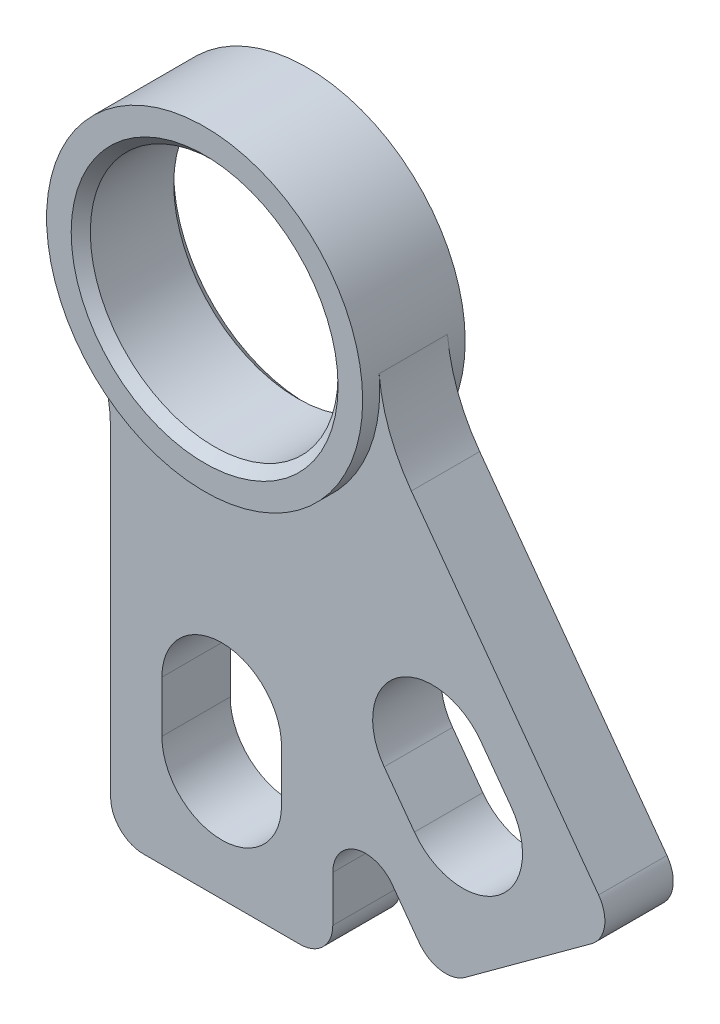
ISO-10303-21;
HEADER;
FILE_DESCRIPTION(('STEP AP214'),'2;1');
FILE_NAME('part.step','',(''),(''),'','','');
FILE_SCHEMA(('AUTOMOTIVE_DESIGN { 1 0 10303 214 1 1 1 1 }'));
ENDSEC;
DATA;
#1=APPLICATION_CONTEXT('core data for automotive mechanical design processes');
#2=APPLICATION_PROTOCOL_DEFINITION('international standard','automotive_design',2000,#1);
#3=PRODUCT_CONTEXT('',#1,'mechanical');
#4=PRODUCT('Part','Part','',(#3));
#5=PRODUCT_RELATED_PRODUCT_CATEGORY('part','',(#4));
#6=PRODUCT_DEFINITION_FORMATION('','',#4);
#7=PRODUCT_DEFINITION_CONTEXT('part definition',#1,'design');
#8=PRODUCT_DEFINITION('design','',#6,#7);
#9=PRODUCT_DEFINITION_SHAPE('','',#8);
#10=(LENGTH_UNIT() NAMED_UNIT(*) SI_UNIT(.MILLI.,.METRE.));
#11=(NAMED_UNIT(*) PLANE_ANGLE_UNIT() SI_UNIT($,.RADIAN.));
#12=(NAMED_UNIT(*) SI_UNIT($,.STERADIAN.) SOLID_ANGLE_UNIT());
#13=UNCERTAINTY_MEASURE_WITH_UNIT(LENGTH_MEASURE(1.E-05),#10,'distance_accuracy_value','');
#14=(GEOMETRIC_REPRESENTATION_CONTEXT(3) GLOBAL_UNCERTAINTY_ASSIGNED_CONTEXT((#13)) GLOBAL_UNIT_ASSIGNED_CONTEXT((#10,
#11,#12)) REPRESENTATION_CONTEXT('',''));
#15=CARTESIAN_POINT('',(0.,0.,0.));
#16=DIRECTION('',(0.,0.,1.));
#17=DIRECTION('',(1.,0.,0.));
#18=AXIS2_PLACEMENT_3D('',#15,#16,#17);
#19=CARTESIAN_POINT('',(0.,0.,4.7625));
#20=DIRECTION('',(0.,0.,-1.));
#21=DIRECTION('',(-1.,0.,0.));
#22=AXIS2_PLACEMENT_3D('',#19,#20,#21);
#23=CYLINDRICAL_SURFACE('',#22,11.5062);
#24=CARTESIAN_POINT('',(0.,0.,-3.87350000000004));
#25=DIRECTION('',(0.,0.,1.));
#26=DIRECTION('',(1.,0.,0.));
#27=AXIS2_PLACEMENT_3D('',#24,#25,#26);
#28=CIRCLE('',#27,11.5062);
#29=CARTESIAN_POINT('',(11.5062,0.,-3.87350000000004));
#30=VERTEX_POINT('',#29);
#31=EDGE_CURVE('E43',#30,#30,#28,.F.);
#32=ORIENTED_EDGE('',*,*,#31,.T.);
#33=EDGE_LOOP('',(#32));
#34=FACE_BOUND('',#33,.T.);
#35=CARTESIAN_POINT('',(0.,0.,3.87349999999998));
#36=DIRECTION('',(0.,0.,1.));
#37=DIRECTION('',(1.,0.,0.));
#38=AXIS2_PLACEMENT_3D('',#35,#36,#37);
#39=CIRCLE('',#38,11.5062);
#40=CARTESIAN_POINT('',(11.5062,0.,3.87349999999998));
#41=VERTEX_POINT('',#40);
#42=EDGE_CURVE('E370',#41,#41,#39,.T.);
#43=ORIENTED_EDGE('',*,*,#42,.T.);
#44=EDGE_LOOP('',(#43));
#45=FACE_BOUND('',#44,.T.);
#46=ADVANCED_FACE('F35',(#34,#45),#23,.F.);
#47=CARTESIAN_POINT('',(0.,0.,4.7625));
#48=DIRECTION('',(0.,0.,-1.));
#49=DIRECTION('',(-1.,0.,0.));
#50=AXIS2_PLACEMENT_3D('',#47,#48,#49);
#51=CYLINDRICAL_SURFACE('',#50,14.6812);
#52=DIRECTION('',(0.,0.,-1.));
#53=VECTOR('',#52,1.);
#54=CARTESIAN_POINT('',(-12.585193266832,-7.55979787272687,3.175));
#55=LINE('',#54,#53);
#56=CARTESIAN_POINT('',(-12.585193266832,-7.55979787272688,3.175));
#57=VERTEX_POINT('',#56);
#58=CARTESIAN_POINT('',(-12.585193266832,-7.55979787272687,-3.175));
#59=VERTEX_POINT('',#58);
#60=EDGE_CURVE('E197',#57,#59,#55,.T.);
#61=ORIENTED_EDGE('',*,*,#60,.F.);
#62=CARTESIAN_POINT('',(0.,0.,3.175));
#63=DIRECTION('',(0.,0.,1.));
#64=DIRECTION('',(1.,0.,0.));
#65=AXIS2_PLACEMENT_3D('',#62,#63,#64);
#66=CIRCLE('',#65,14.6812);
#67=CARTESIAN_POINT('',(14.6214976963152,1.32266343286804,3.175));
#68=VERTEX_POINT('',#67);
#69=EDGE_CURVE('E213',#57,#68,#66,.T.);
#70=ORIENTED_EDGE('',*,*,#69,.T.);
#71=DIRECTION('',(0.,0.,-1.));
#72=VECTOR('',#71,1.);
#73=CARTESIAN_POINT('',(14.6214976963153,1.32266343286796,3.175));
#74=LINE('',#73,#72);
#75=CARTESIAN_POINT('',(14.6214976963153,1.32266343286796,-3.175));
#76=VERTEX_POINT('',#75);
#77=EDGE_CURVE('E253',#68,#76,#74,.T.);
#78=ORIENTED_EDGE('',*,*,#77,.T.);
#79=CARTESIAN_POINT('',(0.,0.,-3.175));
#80=DIRECTION('',(0.,0.,1.));
#81=DIRECTION('',(1.,0.,0.));
#82=AXIS2_PLACEMENT_3D('',#79,#80,#81);
#83=CIRCLE('',#82,14.6812);
#84=EDGE_CURVE('E254',#59,#76,#83,.T.);
#85=ORIENTED_EDGE('',*,*,#84,.F.);
#86=EDGE_LOOP('',(#61,#70,#78,#85));
#87=FACE_BOUND('',#86,.T.);
#88=CARTESIAN_POINT('',(0.,0.,4.7625));
#89=DIRECTION('',(0.,0.,1.));
#90=DIRECTION('',(1.,0.,0.));
#91=AXIS2_PLACEMENT_3D('',#88,#89,#90);
#92=CIRCLE('',#91,14.6812);
#93=CARTESIAN_POINT('',(14.6812,0.,4.7625));
#94=VERTEX_POINT('',#93);
#95=EDGE_CURVE('E320',#94,#94,#92,.T.);
#96=ORIENTED_EDGE('',*,*,#95,.F.);
#97=EDGE_LOOP('',(#96));
#98=FACE_BOUND('',#97,.T.);
#99=CARTESIAN_POINT('',(0.,0.,-4.7625));
#100=DIRECTION('',(0.,0.,1.));
#101=DIRECTION('',(1.,0.,0.));
#102=AXIS2_PLACEMENT_3D('',#99,#100,#101);
#103=CIRCLE('',#102,14.6812);
#104=CARTESIAN_POINT('',(14.6812,0.,-4.7625));
#105=VERTEX_POINT('',#104);
#106=EDGE_CURVE('E308',#105,#105,#103,.T.);
#107=ORIENTED_EDGE('',*,*,#106,.T.);
#108=EDGE_LOOP('',(#107));
#109=FACE_BOUND('',#108,.T.);
#110=ADVANCED_FACE('F391',(#87,#98,#109),#51,.T.);
#111=CARTESIAN_POINT('',(0.,0.,4.7625));
#112=DIRECTION('',(0.,0.,1.));
#113=DIRECTION('',(1.,0.,0.));
#114=AXIS2_PLACEMENT_3D('',#111,#112,#113);
#115=PLANE('',#114);
#116=CARTESIAN_POINT('',(0.,0.,4.7625));
#117=DIRECTION('',(0.,0.,1.));
#118=DIRECTION('',(1.,0.,0.));
#119=AXIS2_PLACEMENT_3D('',#116,#117,#118);
#120=CIRCLE('',#119,12.3952);
#121=CARTESIAN_POINT('',(12.3952,0.,4.7625));
#122=VERTEX_POINT('',#121);
#123=EDGE_CURVE('E11',#122,#122,#120,.F.);
#124=ORIENTED_EDGE('',*,*,#123,.T.);
#125=EDGE_LOOP('',(#124));
#126=FACE_BOUND('',#125,.T.);
#127=ORIENTED_EDGE('',*,*,#95,.T.);
#128=EDGE_LOOP('',(#127));
#129=FACE_BOUND('',#128,.T.);
#130=ADVANCED_FACE('F387',(#126,#129),#115,.T.);
#131=CARTESIAN_POINT('',(0.,0.,-4.7625));
#132=DIRECTION('',(0.,0.,1.));
#133=DIRECTION('',(1.,0.,0.));
#134=AXIS2_PLACEMENT_3D('',#131,#132,#133);
#135=PLANE('',#134);
#136=CARTESIAN_POINT('',(0.,0.,-4.7625));
#137=DIRECTION('',(0.,0.,1.));
#138=DIRECTION('',(1.,0.,0.));
#139=AXIS2_PLACEMENT_3D('',#136,#137,#138);
#140=CIRCLE('',#139,12.3952);
#141=CARTESIAN_POINT('',(12.3952,0.,-4.7625));
#142=VERTEX_POINT('',#141);
#143=EDGE_CURVE('E367',#142,#142,#140,.T.);
#144=ORIENTED_EDGE('',*,*,#143,.T.);
#145=EDGE_LOOP('',(#144));
#146=FACE_BOUND('',#145,.T.);
#147=ORIENTED_EDGE('',*,*,#106,.F.);
#148=EDGE_LOOP('',(#147));
#149=FACE_BOUND('',#148,.T.);
#150=ADVANCED_FACE('F383',(#146,#149),#135,.F.);
#151=CARTESIAN_POINT('',(0.,-33.1787499999983,3.175));
#152=DIRECTION('',(0.,0.,-1.));
#153=DIRECTION('',(-1.,0.,0.));
#154=AXIS2_PLACEMENT_3D('',#151,#152,#153);
#155=CYLINDRICAL_SURFACE('',#154,5.55624999999838);
#156=CARTESIAN_POINT('',(0.,-33.1787499999983,-3.175));
#157=DIRECTION('',(0.,0.,1.));
#158=DIRECTION('',(1.,0.,0.));
#159=AXIS2_PLACEMENT_3D('',#156,#157,#158);
#160=CIRCLE('',#159,5.55624999999838);
#161=CARTESIAN_POINT('',(5.55624999999832,-33.1787499999983,-3.175));
#162=VERTEX_POINT('',#161);
#163=CARTESIAN_POINT('',(-5.55624999999843,-33.1787499999983,-3.175));
#164=VERTEX_POINT('',#163);
#165=EDGE_CURVE('E288',#162,#164,#160,.T.);
#166=ORIENTED_EDGE('',*,*,#165,.F.);
#167=DIRECTION('',(0.,0.,-1.));
#168=VECTOR('',#167,1.);
#169=CARTESIAN_POINT('',(5.55624999999832,-33.1787499999983,3.175));
#170=LINE('',#169,#168);
#171=CARTESIAN_POINT('',(5.55624999999832,-33.1787499999983,3.175));
#172=VERTEX_POINT('',#171);
#173=EDGE_CURVE('E306',#172,#162,#170,.T.);
#174=ORIENTED_EDGE('',*,*,#173,.F.);
#175=CARTESIAN_POINT('',(0.,-33.1787499999983,3.175));
#176=DIRECTION('',(0.,0.,1.));
#177=DIRECTION('',(1.,0.,0.));
#178=AXIS2_PLACEMENT_3D('',#175,#176,#177);
#179=CIRCLE('',#178,5.55624999999838);
#180=CARTESIAN_POINT('',(-5.55624999999843,-33.1787499999983,3.175));
#181=VERTEX_POINT('',#180);
#182=EDGE_CURVE('E242',#172,#181,#179,.T.);
#183=ORIENTED_EDGE('',*,*,#182,.T.);
#184=DIRECTION('',(0.,0.,-1.));
#185=VECTOR('',#184,1.);
#186=CARTESIAN_POINT('',(-5.55624999999843,-33.1787499999983,3.175));
#187=LINE('',#186,#185);
#188=EDGE_CURVE('E299',#181,#164,#187,.T.);
#189=ORIENTED_EDGE('',*,*,#188,.T.);
#190=EDGE_LOOP('',(#166,#174,#183,#189));
#191=FACE_BOUND('',#190,.T.);
#192=ADVANCED_FACE('F386',(#191),#155,.F.);
#193=CARTESIAN_POINT('',(5.55624999999833,0.,3.175));
#194=DIRECTION('',(-1.,0.,0.));
#195=DIRECTION('',(0.,-1.,0.));
#196=AXIS2_PLACEMENT_3D('',#193,#194,#195);
#197=PLANE('',#196);
#198=DIRECTION('',(0.,1.,0.));
#199=VECTOR('',#198,1.);
#200=CARTESIAN_POINT('',(5.55624999999833,0.,-3.175));
#201=LINE('',#200,#199);
#202=CARTESIAN_POINT('',(5.55624999999832,-37.9412500000015,-3.175));
#203=VERTEX_POINT('',#202);
#204=EDGE_CURVE('E291',#203,#162,#201,.T.);
#205=ORIENTED_EDGE('',*,*,#204,.F.);
#206=DIRECTION('',(0.,0.,-1.));
#207=VECTOR('',#206,1.);
#208=CARTESIAN_POINT('',(5.55624999999832,-37.9412500000015,3.175));
#209=LINE('',#208,#207);
#210=CARTESIAN_POINT('',(5.55624999999832,-37.9412500000015,3.175));
#211=VERTEX_POINT('',#210);
#212=EDGE_CURVE('E304',#211,#203,#209,.T.);
#213=ORIENTED_EDGE('',*,*,#212,.F.);
#214=DIRECTION('',(0.,1.,0.));
#215=VECTOR('',#214,1.);
#216=CARTESIAN_POINT('',(5.55624999999833,0.,3.175));
#217=LINE('',#216,#215);
#218=EDGE_CURVE('E245',#211,#172,#217,.T.);
#219=ORIENTED_EDGE('',*,*,#218,.T.);
#220=ORIENTED_EDGE('',*,*,#173,.T.);
#221=EDGE_LOOP('',(#205,#213,#219,#220));
#222=FACE_BOUND('',#221,.T.);
#223=ADVANCED_FACE('F530',(#222),#197,.T.);
#224=CARTESIAN_POINT('',(0.,-37.9412500000015,3.175));
#225=DIRECTION('',(0.,0.,-1.));
#226=DIRECTION('',(-1.,0.,0.));
#227=AXIS2_PLACEMENT_3D('',#224,#225,#226);
#228=CYLINDRICAL_SURFACE('',#227,5.55624999999838);
#229=CARTESIAN_POINT('',(0.,-37.9412500000015,-3.175));
#230=DIRECTION('',(0.,0.,1.));
#231=DIRECTION('',(1.,0.,0.));
#232=AXIS2_PLACEMENT_3D('',#229,#230,#231);
#233=CIRCLE('',#232,5.55624999999838);
#234=CARTESIAN_POINT('',(-5.55624999999843,-37.9412500000015,-3.175));
#235=VERTEX_POINT('',#234);
#236=EDGE_CURVE('E294',#235,#203,#233,.T.);
#237=ORIENTED_EDGE('',*,*,#236,.F.);
#238=DIRECTION('',(0.,0.,-1.));
#239=VECTOR('',#238,1.);
#240=CARTESIAN_POINT('',(-5.55624999999843,-37.9412500000015,3.175));
#241=LINE('',#240,#239);
#242=CARTESIAN_POINT('',(-5.55624999999843,-37.9412500000015,3.175));
#243=VERTEX_POINT('',#242);
#244=EDGE_CURVE('E301',#243,#235,#241,.T.);
#245=ORIENTED_EDGE('',*,*,#244,.F.);
#246=CARTESIAN_POINT('',(0.,-37.9412500000015,3.175));
#247=DIRECTION('',(0.,0.,1.));
#248=DIRECTION('',(1.,0.,0.));
#249=AXIS2_PLACEMENT_3D('',#246,#247,#248);
#250=CIRCLE('',#249,5.55624999999838);
#251=EDGE_CURVE('E248',#243,#211,#250,.T.);
#252=ORIENTED_EDGE('',*,*,#251,.T.);
#253=ORIENTED_EDGE('',*,*,#212,.T.);
#254=EDGE_LOOP('',(#237,#245,#252,#253));
#255=FACE_BOUND('',#254,.T.);
#256=ADVANCED_FACE('F497',(#255),#228,.F.);
#257=CARTESIAN_POINT('',(19.577669676264,-26.7870174078692,3.175));
#258=DIRECTION('',(0.,0.,-1.));
#259=DIRECTION('',(-1.,0.,0.));
#260=AXIS2_PLACEMENT_3D('',#257,#258,#259);
#261=CYLINDRICAL_SURFACE('',#260,5.5562499999983);
#262=CARTESIAN_POINT('',(19.577669676264,-26.7870174078692,-3.175));
#263=DIRECTION('',(0.,0.,1.));
#264=DIRECTION('',(1.,0.,0.));
#265=AXIS2_PLACEMENT_3D('',#262,#263,#264);
#266=CIRCLE('',#265,5.5562499999983);
#267=CARTESIAN_POINT('',(24.0635338354753,-23.5084602850507,-3.175));
#268=VERTEX_POINT('',#267);
#269=CARTESIAN_POINT('',(15.0918055170525,-30.0655745306877,-3.175));
#270=VERTEX_POINT('',#269);
#271=EDGE_CURVE('E276',#268,#270,#266,.T.);
#272=ORIENTED_EDGE('',*,*,#271,.F.);
#273=DIRECTION('',(0.,0.,-1.));
#274=VECTOR('',#273,1.);
#275=CARTESIAN_POINT('',(24.0635338354753,-23.5084602850507,3.175));
#276=LINE('',#275,#274);
#277=CARTESIAN_POINT('',(24.0635338354753,-23.5084602850507,3.175));
#278=VERTEX_POINT('',#277);
#279=EDGE_CURVE('E302',#278,#268,#276,.T.);
#280=ORIENTED_EDGE('',*,*,#279,.F.);
#281=CARTESIAN_POINT('',(19.577669676264,-26.7870174078692,3.175));
#282=DIRECTION('',(0.,0.,1.));
#283=DIRECTION('',(1.,0.,0.));
#284=AXIS2_PLACEMENT_3D('',#281,#282,#283);
#285=CIRCLE('',#284,5.5562499999983);
#286=CARTESIAN_POINT('',(15.0918055170525,-30.0655745306877,3.175));
#287=VERTEX_POINT('',#286);
#288=EDGE_CURVE('E231',#278,#287,#285,.T.);
#289=ORIENTED_EDGE('',*,*,#288,.T.);
#290=DIRECTION('',(0.,0.,-1.));
#291=VECTOR('',#290,1.);
#292=CARTESIAN_POINT('',(15.0918055170525,-30.0655745306877,3.175));
#293=LINE('',#292,#291);
#294=EDGE_CURVE('E309',#287,#270,#293,.T.);
#295=ORIENTED_EDGE('',*,*,#294,.T.);
#296=EDGE_LOOP('',(#272,#280,#289,#295));
#297=FACE_BOUND('',#296,.T.);
#298=ADVANCED_FACE('F489',(#297),#261,.F.);
#299=CARTESIAN_POINT('',(4.4858641592114,3.27855712281848,3.175));
#300=DIRECTION('',(-0.807354629329632,-0.590066523792032,0.));
#301=DIRECTION('',(0.590066523792032,-0.807354629329632,0.));
#302=AXIS2_PLACEMENT_3D('',#299,#300,#301);
#303=PLANE('',#302);
#304=DIRECTION('',(-0.590066523792032,0.807354629329632,0.));
#305=VECTOR('',#304,1.);
#306=CARTESIAN_POINT('',(4.4858641592114,3.27855712281848,-3.175));
#307=LINE('',#306,#305);
#308=CARTESIAN_POINT('',(26.8737256550367,-27.3534867072357,-3.175));
#309=VERTEX_POINT('',#308);
#310=EDGE_CURVE('E279',#309,#268,#307,.T.);
#311=ORIENTED_EDGE('',*,*,#310,.F.);
#312=DIRECTION('',(0.,0.,-1.));
#313=VECTOR('',#312,1.);
#314=CARTESIAN_POINT('',(26.8737256550367,-27.3534867072357,3.175));
#315=LINE('',#314,#313);
#316=CARTESIAN_POINT('',(26.8737256550367,-27.3534867072357,3.175));
#317=VERTEX_POINT('',#316);
#318=EDGE_CURVE('E313',#317,#309,#315,.T.);
#319=ORIENTED_EDGE('',*,*,#318,.F.);
#320=DIRECTION('',(-0.590066523792032,0.807354629329632,0.));
#321=VECTOR('',#320,1.);
#322=CARTESIAN_POINT('',(4.4858641592114,3.27855712281848,3.175));
#323=LINE('',#322,#321);
#324=EDGE_CURVE('E234',#317,#278,#323,.T.);
#325=ORIENTED_EDGE('',*,*,#324,.T.);
#326=ORIENTED_EDGE('',*,*,#279,.T.);
#327=EDGE_LOOP('',(#311,#319,#325,#326));
#328=FACE_BOUND('',#327,.T.);
#329=ADVANCED_FACE('F483',(#328),#303,.T.);
#330=CARTESIAN_POINT('',(22.3878614958254,-30.6320438300541,3.175));
#331=DIRECTION('',(0.,0.,-1.));
#332=DIRECTION('',(-1.,0.,0.));
#333=AXIS2_PLACEMENT_3D('',#330,#331,#332);
#334=CYLINDRICAL_SURFACE('',#333,5.5562499999983);
#335=CARTESIAN_POINT('',(22.3878614958254,-30.6320438300541,-3.175));
#336=DIRECTION('',(0.,0.,1.));
#337=DIRECTION('',(1.,0.,0.));
#338=AXIS2_PLACEMENT_3D('',#335,#336,#337);
#339=CIRCLE('',#338,5.5562499999983);
#340=CARTESIAN_POINT('',(17.901997336614,-33.9106009528726,-3.175));
#341=VERTEX_POINT('',#340);
#342=EDGE_CURVE('E282',#341,#309,#339,.T.);
#343=ORIENTED_EDGE('',*,*,#342,.F.);
#344=DIRECTION('',(0.,0.,-1.));
#345=VECTOR('',#344,1.);
#346=CARTESIAN_POINT('',(17.901997336614,-33.9106009528726,3.175));
#347=LINE('',#346,#345);
#348=CARTESIAN_POINT('',(17.901997336614,-33.9106009528726,3.175));
#349=VERTEX_POINT('',#348);
#350=EDGE_CURVE('E311',#349,#341,#347,.T.);
#351=ORIENTED_EDGE('',*,*,#350,.F.);
#352=CARTESIAN_POINT('',(22.3878614958254,-30.6320438300541,3.175));
#353=DIRECTION('',(0.,0.,1.));
#354=DIRECTION('',(1.,0.,0.));
#355=AXIS2_PLACEMENT_3D('',#352,#353,#354);
#356=CIRCLE('',#355,5.5562499999983);
#357=EDGE_CURVE('E237',#349,#317,#356,.T.);
#358=ORIENTED_EDGE('',*,*,#357,.T.);
#359=ORIENTED_EDGE('',*,*,#318,.T.);
#360=EDGE_LOOP('',(#343,#351,#358,#359));
#361=FACE_BOUND('',#360,.T.);
#362=ADVANCED_FACE('F479',(#361),#334,.F.);
#363=CARTESIAN_POINT('',(-26.1937499999968,-15.7343197939273,3.175));
#364=DIRECTION('',(0.,0.,-1.));
#365=DIRECTION('',(-1.,0.,0.));
#366=AXIS2_PLACEMENT_3D('',#363,#364,#365);
#367=CYLINDRICAL_SURFACE('',#366,15.8749999999984);
#368=CARTESIAN_POINT('',(-26.1937499999968,-15.7343197939273,-3.175));
#369=DIRECTION('',(0.,0.,1.));
#370=DIRECTION('',(1.,0.,0.));
#371=AXIS2_PLACEMENT_3D('',#368,#369,#370);
#372=CIRCLE('',#371,15.8749999999984);
#373=CARTESIAN_POINT('',(-10.3187499999984,-15.7343197939273,-3.175));
#374=VERTEX_POINT('',#373);
#375=EDGE_CURVE('E193',#374,#59,#372,.T.);
#376=ORIENTED_EDGE('',*,*,#375,.F.);
#377=DIRECTION('',(0.,0.,-1.));
#378=VECTOR('',#377,1.);
#379=CARTESIAN_POINT('',(-10.3187499999984,-15.7343197939273,3.175));
#380=LINE('',#379,#378);
#381=CARTESIAN_POINT('',(-10.3187499999984,-15.7343197939273,3.175));
#382=VERTEX_POINT('',#381);
#383=EDGE_CURVE('E186',#382,#374,#380,.T.);
#384=ORIENTED_EDGE('',*,*,#383,.F.);
#385=CARTESIAN_POINT('',(-26.1937499999968,-15.7343197939273,3.175));
#386=DIRECTION('',(0.,0.,1.));
#387=DIRECTION('',(1.,0.,0.));
#388=AXIS2_PLACEMENT_3D('',#385,#386,#387);
#389=CIRCLE('',#388,15.8749999999984);
#390=EDGE_CURVE('E191',#382,#57,#389,.T.);
#391=ORIENTED_EDGE('',*,*,#390,.T.);
#392=ORIENTED_EDGE('',*,*,#60,.T.);
#393=EDGE_LOOP('',(#376,#384,#391,#392));
#394=FACE_BOUND('',#393,.T.);
#395=ADVANCED_FACE('F188',(#394),#367,.F.);
#396=CARTESIAN_POINT('',(-10.3187499999983,0.,3.175));
#397=DIRECTION('',(1.,0.,0.));
#398=DIRECTION('',(0.,1.,0.));
#399=AXIS2_PLACEMENT_3D('',#396,#397,#398);
#400=PLANE('',#399);
#401=DIRECTION('',(0.,-1.,0.));
#402=VECTOR('',#401,1.);
#403=CARTESIAN_POINT('',(-10.3187499999983,0.,-3.175));
#404=LINE('',#403,#402);
#405=CARTESIAN_POINT('',(-10.3187499999984,-45.2119999999998,-3.175));
#406=VERTEX_POINT('',#405);
#407=EDGE_CURVE('E258',#374,#406,#404,.T.);
#408=ORIENTED_EDGE('',*,*,#407,.T.);
#409=DIRECTION('',(0.,0.,-1.));
#410=VECTOR('',#409,1.);
#411=CARTESIAN_POINT('',(-10.3187499999984,-45.2119999999998,3.175));
#412=LINE('',#411,#410);
#413=CARTESIAN_POINT('',(-10.3187499999984,-45.2119999999998,3.175));
#414=VERTEX_POINT('',#413);
#415=EDGE_CURVE('E204',#406,#414,#412,.F.);
#416=ORIENTED_EDGE('',*,*,#415,.T.);
#417=DIRECTION('',(0.,-1.,0.));
#418=VECTOR('',#417,1.);
#419=CARTESIAN_POINT('',(-10.3187499999983,0.,3.175));
#420=LINE('',#419,#418);
#421=EDGE_CURVE('E201',#382,#414,#420,.T.);
#422=ORIENTED_EDGE('',*,*,#421,.F.);
#423=ORIENTED_EDGE('',*,*,#383,.T.);
#424=EDGE_LOOP('',(#408,#416,#422,#423));
#425=FACE_BOUND('',#424,.T.);
#426=ADVANCED_FACE('F202',(#425),#400,.F.);
#427=CARTESIAN_POINT('',(-2.92074057247586E-13,-48.2599999999998,3.175));
#428=DIRECTION('',(0.,1.,0.));
#429=DIRECTION('',(-1.,0.,0.));
#430=AXIS2_PLACEMENT_3D('',#427,#428,#429);
#431=PLANE('',#430);
#432=DIRECTION('',(1.,0.,0.));
#433=VECTOR('',#432,1.);
#434=CARTESIAN_POINT('',(-2.92074057247586E-13,-48.2599999999998,-3.175));
#435=LINE('',#434,#433);
#436=CARTESIAN_POINT('',(-7.27074999999845,-48.2599999999998,-3.175));
#437=VERTEX_POINT('',#436);
#438=CARTESIAN_POINT('',(7.27074999999832,-48.2599999999999,-3.175));
#439=VERTEX_POINT('',#438);
#440=EDGE_CURVE('E260',#437,#439,#435,.T.);
#441=ORIENTED_EDGE('',*,*,#440,.T.);
#442=DIRECTION('',(0.,0.,-1.));
#443=VECTOR('',#442,1.);
#444=CARTESIAN_POINT('',(7.27074999999832,-48.2599999999999,3.175));
#445=LINE('',#444,#443);
#446=CARTESIAN_POINT('',(7.27074999999832,-48.2599999999999,3.175));
#447=VERTEX_POINT('',#446);
#448=EDGE_CURVE('E346',#439,#447,#445,.F.);
#449=ORIENTED_EDGE('',*,*,#448,.T.);
#450=DIRECTION('',(1.,0.,0.));
#451=VECTOR('',#450,1.);
#452=CARTESIAN_POINT('',(-2.92074057247586E-13,-48.2599999999998,3.175));
#453=LINE('',#452,#451);
#454=CARTESIAN_POINT('',(-7.27074999999845,-48.2599999999998,3.175));
#455=VERTEX_POINT('',#454);
#456=EDGE_CURVE('E206',#455,#447,#453,.T.);
#457=ORIENTED_EDGE('',*,*,#456,.F.);
#458=DIRECTION('',(0.,0.,-1.));
#459=VECTOR('',#458,1.);
#460=CARTESIAN_POINT('',(-7.27074999999845,-48.2599999999998,3.175));
#461=LINE('',#460,#459);
#462=EDGE_CURVE('E343',#455,#437,#461,.T.);
#463=ORIENTED_EDGE('',*,*,#462,.T.);
#464=EDGE_LOOP('',(#441,#449,#457,#463));
#465=FACE_BOUND('',#464,.T.);
#466=ADVANCED_FACE('F444',(#465),#431,.F.);
#467=CARTESIAN_POINT('',(10.3187499999982,0.,3.175));
#468=DIRECTION('',(-1.,0.,0.));
#469=DIRECTION('',(0.,-1.,0.));
#470=AXIS2_PLACEMENT_3D('',#467,#468,#469);
#471=PLANE('',#470);
#472=DIRECTION('',(0.,1.,0.));
#473=VECTOR('',#472,1.);
#474=CARTESIAN_POINT('',(10.3187499999982,0.,-3.175));
#475=LINE('',#474,#473);
#476=CARTESIAN_POINT('',(10.3187499999983,-45.2119999999999,-3.175));
#477=VERTEX_POINT('',#476);
#478=CARTESIAN_POINT('',(10.3187499999983,-40.9419218299925,-3.175));
#479=VERTEX_POINT('',#478);
#480=EDGE_CURVE('E263',#477,#479,#475,.T.);
#481=ORIENTED_EDGE('',*,*,#480,.T.);
#482=DIRECTION('',(0.,0.,-1.));
#483=VECTOR('',#482,1.);
#484=CARTESIAN_POINT('',(10.3187499999983,-40.9419218299925,3.175));
#485=LINE('',#484,#483);
#486=CARTESIAN_POINT('',(10.3187499999983,-40.9419218299925,3.175));
#487=VERTEX_POINT('',#486);
#488=EDGE_CURVE('E333',#479,#487,#485,.F.);
#489=ORIENTED_EDGE('',*,*,#488,.T.);
#490=DIRECTION('',(0.,1.,0.));
#491=VECTOR('',#490,1.);
#492=CARTESIAN_POINT('',(10.3187499999982,0.,3.175));
#493=LINE('',#492,#491);
#494=CARTESIAN_POINT('',(10.3187499999983,-45.2119999999999,3.175));
#495=VERTEX_POINT('',#494);
#496=EDGE_CURVE('E219',#495,#487,#493,.T.);
#497=ORIENTED_EDGE('',*,*,#496,.F.);
#498=DIRECTION('',(0.,0.,-1.));
#499=VECTOR('',#498,1.);
#500=CARTESIAN_POINT('',(10.3187499999983,-45.2119999999999,3.175));
#501=LINE('',#500,#499);
#502=EDGE_CURVE('E330',#495,#477,#501,.T.);
#503=ORIENTED_EDGE('',*,*,#502,.T.);
#504=EDGE_LOOP('',(#481,#489,#497,#503));
#505=FACE_BOUND('',#504,.T.);
#506=ADVANCED_FACE('F450',(#505),#471,.F.);
#507=CARTESIAN_POINT('',(-8.33089058139375,-6.08874894237801,3.175));
#508=DIRECTION('',(-0.807354629329632,-0.590066523792032,0.));
#509=DIRECTION('',(0.590066523792032,-0.807354629329632,0.));
#510=AXIS2_PLACEMENT_3D('',#507,#508,#509);
#511=PLANE('',#510);
#512=DIRECTION('',(-0.590066523792032,0.807354629329632,0.));
#513=VECTOR('',#512,1.);
#514=CARTESIAN_POINT('',(-8.33089058139375,-6.08874894237801,3.175));
#515=LINE('',#514,#513);
#516=CARTESIAN_POINT('',(18.3471970922916,-42.5908664436293,3.175));
#517=VERTEX_POINT('',#516);
#518=CARTESIAN_POINT('',(15.827566910195,-39.1433990654744,3.175));
#519=VERTEX_POINT('',#518);
#520=EDGE_CURVE('E222',#517,#519,#515,.T.);
#521=ORIENTED_EDGE('',*,*,#520,.T.);
#522=DIRECTION('',(0.,0.,-1.));
#523=VECTOR('',#522,1.);
#524=CARTESIAN_POINT('',(15.827566910195,-39.1433990654744,3.175));
#525=LINE('',#524,#523);
#526=CARTESIAN_POINT('',(15.827566910195,-39.1433990654744,-3.175));
#527=VERTEX_POINT('',#526);
#528=EDGE_CURVE('E327',#519,#527,#525,.T.);
#529=ORIENTED_EDGE('',*,*,#528,.T.);
#530=DIRECTION('',(-0.590066523792032,0.807354629329632,0.));
#531=VECTOR('',#530,1.);
#532=CARTESIAN_POINT('',(-8.33089058139375,-6.08874894237801,-3.175));
#533=LINE('',#532,#531);
#534=CARTESIAN_POINT('',(18.3471970922916,-42.5908664436293,-3.175));
#535=VERTEX_POINT('',#534);
#536=EDGE_CURVE('E266',#535,#527,#533,.T.);
#537=ORIENTED_EDGE('',*,*,#536,.F.);
#538=DIRECTION('',(0.,0.,-1.));
#539=VECTOR('',#538,1.);
#540=CARTESIAN_POINT('',(18.3471970922916,-42.5908664436293,3.175));
#541=LINE('',#540,#539);
#542=EDGE_CURVE('E323',#535,#517,#541,.F.);
#543=ORIENTED_EDGE('',*,*,#542,.T.);
#544=EDGE_LOOP('',(#521,#529,#537,#543));
#545=FACE_BOUND('',#544,.T.);
#546=ADVANCED_FACE('F456',(#545),#511,.T.);
#547=CARTESIAN_POINT('',(28.4766104382034,-38.962934411448,3.175));
#548=DIRECTION('',(-0.590066523792032,0.807354629329632,0.));
#549=DIRECTION('',(-0.807354629329632,-0.590066523792032,0.));
#550=AXIS2_PLACEMENT_3D('',#547,#548,#549);
#551=PLANE('',#550);
#552=DIRECTION('',(0.807354629329632,0.590066523792032,0.));
#553=VECTOR('',#552,1.);
#554=CARTESIAN_POINT('',(28.4766104382034,-38.962934411448,3.175));
#555=LINE('',#554,#553);
#556=CARTESIAN_POINT('',(22.6065367670064,-43.2531605893079,3.175));
#557=VERTEX_POINT('',#556);
#558=CARTESIAN_POINT('',(34.3466841094006,-34.672708233588,3.175));
#559=VERTEX_POINT('',#558);
#560=EDGE_CURVE('E225',#557,#559,#555,.T.);
#561=ORIENTED_EDGE('',*,*,#560,.F.);
#562=DIRECTION('',(0.,0.,-1.));
#563=VECTOR('',#562,1.);
#564=CARTESIAN_POINT('',(22.6065367670064,-43.2531605893079,-3.175));
#565=LINE('',#564,#563);
#566=CARTESIAN_POINT('',(22.6065367670064,-43.2531605893079,-3.175));
#567=VERTEX_POINT('',#566);
#568=EDGE_CURVE('E356',#557,#567,#565,.T.);
#569=ORIENTED_EDGE('',*,*,#568,.T.);
#570=DIRECTION('',(0.807354629329632,0.590066523792032,0.));
#571=VECTOR('',#570,1.);
#572=CARTESIAN_POINT('',(28.4766104382034,-38.962934411448,-3.175));
#573=LINE('',#572,#571);
#574=CARTESIAN_POINT('',(34.3466841094006,-34.672708233588,-3.175));
#575=VERTEX_POINT('',#574);
#576=EDGE_CURVE('E269',#567,#575,#573,.T.);
#577=ORIENTED_EDGE('',*,*,#576,.T.);
#578=DIRECTION('',(0.,0.,-1.));
#579=VECTOR('',#578,1.);
#580=CARTESIAN_POINT('',(34.3466841094006,-34.672708233588,3.175));
#581=LINE('',#580,#579);
#582=EDGE_CURVE('E58',#575,#559,#581,.F.);
#583=ORIENTED_EDGE('',*,*,#582,.T.);
#584=EDGE_LOOP('',(#561,#569,#577,#583));
#585=FACE_BOUND('',#584,.T.);
#586=ADVANCED_FACE('F460',(#585),#551,.F.);
#587=CARTESIAN_POINT('',(8.33089058139352,6.08874894237796,3.175));
#588=DIRECTION('',(-0.807354629329627,-0.590066523792039,0.));
#589=DIRECTION('',(0.590066523792039,-0.807354629329627,0.));
#590=AXIS2_PLACEMENT_3D('',#587,#588,#589);
#591=PLANE('',#590);
#592=DIRECTION('',(-0.590066523792039,0.807354629329627,0.));
#593=VECTOR('',#592,1.);
#594=CARTESIAN_POINT('',(8.33089058139352,6.08874894237796,3.175));
#595=LINE('',#594,#593);
#596=CARTESIAN_POINT('',(35.0089782550792,-30.4133685588731,3.175));
#597=VERTEX_POINT('',#596);
#598=CARTESIAN_POINT('',(17.6151859664287,-6.61442698260228,3.175));
#599=VERTEX_POINT('',#598);
#600=EDGE_CURVE('E227',#597,#599,#595,.T.);
#601=ORIENTED_EDGE('',*,*,#600,.F.);
#602=DIRECTION('',(0.,0.,-1.));
#603=VECTOR('',#602,1.);
#604=CARTESIAN_POINT('',(35.0089782550792,-30.4133685588731,3.175));
#605=LINE('',#604,#603);
#606=CARTESIAN_POINT('',(35.0089782550792,-30.4133685588731,-3.175));
#607=VERTEX_POINT('',#606);
#608=EDGE_CURVE('E360',#597,#607,#605,.T.);
#609=ORIENTED_EDGE('',*,*,#608,.T.);
#610=DIRECTION('',(-0.590066523792039,0.807354629329627,0.));
#611=VECTOR('',#610,1.);
#612=CARTESIAN_POINT('',(8.33089058139352,6.08874894237796,-3.175));
#613=LINE('',#612,#611);
#614=CARTESIAN_POINT('',(17.6151859664287,-6.61442698260228,-3.175));
#615=VERTEX_POINT('',#614);
#616=EDGE_CURVE('E271',#607,#615,#613,.T.);
#617=ORIENTED_EDGE('',*,*,#616,.T.);
#618=DIRECTION('',(0.,0.,-1.));
#619=VECTOR('',#618,1.);
#620=CARTESIAN_POINT('',(17.6151859664287,-6.61442698260228,3.175));
#621=LINE('',#620,#619);
#622=EDGE_CURVE('E198',#599,#615,#621,.T.);
#623=ORIENTED_EDGE('',*,*,#622,.F.);
#624=EDGE_LOOP('',(#601,#609,#617,#623));
#625=FACE_BOUND('',#624,.T.);
#626=ADVANCED_FACE('F428',(#625),#591,.F.);
#627=CARTESIAN_POINT('',(-4.48586415921139,-3.27855712281846,3.175));
#628=DIRECTION('',(-0.807354629329632,-0.590066523792032,0.));
#629=DIRECTION('',(0.590066523792032,-0.807354629329632,0.));
#630=AXIS2_PLACEMENT_3D('',#627,#628,#629);
#631=PLANE('',#630);
#632=DIRECTION('',(-0.590066523792032,0.807354629329632,0.));
#633=VECTOR('',#632,1.);
#634=CARTESIAN_POINT('',(-4.48586415921139,-3.27855712281846,-3.175));
#635=LINE('',#634,#633);
#636=EDGE_CURVE('E285',#341,#270,#635,.T.);
#637=ORIENTED_EDGE('',*,*,#636,.T.);
#638=ORIENTED_EDGE('',*,*,#294,.F.);
#639=DIRECTION('',(-0.590066523792032,0.807354629329632,0.));
#640=VECTOR('',#639,1.);
#641=CARTESIAN_POINT('',(-4.48586415921139,-3.27855712281846,3.175));
#642=LINE('',#641,#640);
#643=EDGE_CURVE('E240',#349,#287,#642,.T.);
#644=ORIENTED_EDGE('',*,*,#643,.F.);
#645=ORIENTED_EDGE('',*,*,#350,.T.);
#646=EDGE_LOOP('',(#637,#638,#644,#645));
#647=FACE_BOUND('',#646,.T.);
#648=ADVANCED_FACE('F467',(#647),#631,.F.);
#649=CARTESIAN_POINT('',(30.4319407070353,2.75287908259546,3.175));
#650=DIRECTION('',(0.,0.,-1.));
#651=DIRECTION('',(-1.,0.,0.));
#652=AXIS2_PLACEMENT_3D('',#649,#650,#651);
#653=CYLINDRICAL_SURFACE('',#652,15.8749999999985);
#654=CARTESIAN_POINT('',(30.4319407070353,2.75287908259546,-3.175));
#655=DIRECTION('',(0.,0.,1.));
#656=DIRECTION('',(1.,0.,0.));
#657=AXIS2_PLACEMENT_3D('',#654,#655,#656);
#658=CIRCLE('',#657,15.8749999999985);
#659=EDGE_CURVE('E273',#615,#76,#658,.F.);
#660=ORIENTED_EDGE('',*,*,#659,.T.);
#661=ORIENTED_EDGE('',*,*,#77,.F.);
#662=CARTESIAN_POINT('',(30.4319407070353,2.75287908259546,3.175));
#663=DIRECTION('',(0.,0.,1.));
#664=DIRECTION('',(1.,0.,0.));
#665=AXIS2_PLACEMENT_3D('',#662,#663,#664);
#666=CIRCLE('',#665,15.8749999999985);
#667=EDGE_CURVE('E229',#599,#68,#666,.F.);
#668=ORIENTED_EDGE('',*,*,#667,.F.);
#669=ORIENTED_EDGE('',*,*,#622,.T.);
#670=EDGE_LOOP('',(#660,#661,#668,#669));
#671=FACE_BOUND('',#670,.T.);
#672=ADVANCED_FACE('F437',(#671),#653,.F.);
#673=CARTESIAN_POINT('',(-5.55624999999842,0.,3.175));
#674=DIRECTION('',(-1.,0.,0.));
#675=DIRECTION('',(0.,-1.,0.));
#676=AXIS2_PLACEMENT_3D('',#673,#674,#675);
#677=PLANE('',#676);
#678=DIRECTION('',(0.,1.,0.));
#679=VECTOR('',#678,1.);
#680=CARTESIAN_POINT('',(-5.55624999999842,0.,-3.175));
#681=LINE('',#680,#679);
#682=EDGE_CURVE('E215',#235,#164,#681,.T.);
#683=ORIENTED_EDGE('',*,*,#682,.T.);
#684=ORIENTED_EDGE('',*,*,#188,.F.);
#685=DIRECTION('',(0.,1.,0.));
#686=VECTOR('',#685,1.);
#687=CARTESIAN_POINT('',(-5.55624999999842,0.,3.175));
#688=LINE('',#687,#686);
#689=EDGE_CURVE('E251',#243,#181,#688,.T.);
#690=ORIENTED_EDGE('',*,*,#689,.F.);
#691=ORIENTED_EDGE('',*,*,#244,.T.);
#692=EDGE_LOOP('',(#683,#684,#690,#691));
#693=FACE_BOUND('',#692,.T.);
#694=ADVANCED_FACE('F500',(#693),#677,.F.);
#695=CARTESIAN_POINT('',(0.,0.,3.175));
#696=DIRECTION('',(0.,0.,1.));
#697=DIRECTION('',(1.,0.,0.));
#698=AXIS2_PLACEMENT_3D('',#695,#696,#697);
#699=PLANE('',#698);
#700=ORIENTED_EDGE('',*,*,#456,.T.);
#701=CARTESIAN_POINT('',(7.27074999999834,-45.2119999999999,3.175));
#702=DIRECTION('',(0.,0.,1.));
#703=DIRECTION('',(1.,0.,0.));
#704=AXIS2_PLACEMENT_3D('',#701,#702,#703);
#705=CIRCLE('',#704,3.048);
#706=EDGE_CURVE('E353',#447,#495,#705,.T.);
#707=ORIENTED_EDGE('',*,*,#706,.T.);
#708=ORIENTED_EDGE('',*,*,#496,.T.);
#709=CARTESIAN_POINT('',(13.3667499999983,-40.9419218299925,3.175));
#710=DIRECTION('',(0.,0.,1.));
#711=DIRECTION('',(1.,0.,0.));
#712=AXIS2_PLACEMENT_3D('',#709,#710,#711);
#713=CIRCLE('',#712,3.048);
#714=EDGE_CURVE('E365',#487,#519,#713,.F.);
#715=ORIENTED_EDGE('',*,*,#714,.T.);
#716=ORIENTED_EDGE('',*,*,#520,.F.);
#717=CARTESIAN_POINT('',(20.8080140024883,-40.7923436791112,3.175));
#718=DIRECTION('',(0.,0.,1.));
#719=DIRECTION('',(1.,0.,0.));
#720=AXIS2_PLACEMENT_3D('',#717,#718,#719);
#721=CIRCLE('',#720,3.048);
#722=EDGE_CURVE('E351',#517,#557,#721,.T.);
#723=ORIENTED_EDGE('',*,*,#722,.T.);
#724=ORIENTED_EDGE('',*,*,#560,.T.);
#725=CARTESIAN_POINT('',(32.5481613448825,-32.2118913233913,3.175));
#726=DIRECTION('',(0.,0.,1.));
#727=DIRECTION('',(1.,0.,0.));
#728=AXIS2_PLACEMENT_3D('',#725,#726,#727);
#729=CIRCLE('',#728,3.048);
#730=EDGE_CURVE('E50',#559,#597,#729,.T.);
#731=ORIENTED_EDGE('',*,*,#730,.T.);
#732=ORIENTED_EDGE('',*,*,#600,.T.);
#733=ORIENTED_EDGE('',*,*,#667,.T.);
#734=ORIENTED_EDGE('',*,*,#69,.F.);
#735=ORIENTED_EDGE('',*,*,#390,.F.);
#736=ORIENTED_EDGE('',*,*,#421,.T.);
#737=CARTESIAN_POINT('',(-7.27074999999844,-45.2119999999998,3.175));
#738=DIRECTION('',(0.,0.,1.));
#739=DIRECTION('',(1.,0.,0.));
#740=AXIS2_PLACEMENT_3D('',#737,#738,#739);
#741=CIRCLE('',#740,3.048);
#742=EDGE_CURVE('E349',#414,#455,#741,.T.);
#743=ORIENTED_EDGE('',*,*,#742,.T.);
#744=EDGE_LOOP('',(#700,#707,#708,#715,#716,#723,#724,#731,#732,#733,#734,#735,#736,#743));
#745=FACE_BOUND('',#744,.T.);
#746=ORIENTED_EDGE('',*,*,#288,.F.);
#747=ORIENTED_EDGE('',*,*,#324,.F.);
#748=ORIENTED_EDGE('',*,*,#357,.F.);
#749=ORIENTED_EDGE('',*,*,#643,.T.);
#750=EDGE_LOOP('',(#746,#747,#748,#749));
#751=FACE_BOUND('',#750,.T.);
#752=ORIENTED_EDGE('',*,*,#182,.F.);
#753=ORIENTED_EDGE('',*,*,#218,.F.);
#754=ORIENTED_EDGE('',*,*,#251,.F.);
#755=ORIENTED_EDGE('',*,*,#689,.T.);
#756=EDGE_LOOP('',(#752,#753,#754,#755));
#757=FACE_BOUND('',#756,.T.);
#758=ADVANCED_FACE('F210',(#745,#751,#757),#699,.T.);
#759=CARTESIAN_POINT('',(0.,0.,-3.175));
#760=DIRECTION('',(0.,0.,1.));
#761=DIRECTION('',(1.,0.,0.));
#762=AXIS2_PLACEMENT_3D('',#759,#760,#761);
#763=PLANE('',#762);
#764=ORIENTED_EDGE('',*,*,#480,.F.);
#765=CARTESIAN_POINT('',(7.27074999999834,-45.2119999999999,-3.175));
#766=DIRECTION('',(0.,0.,1.));
#767=DIRECTION('',(1.,0.,0.));
#768=AXIS2_PLACEMENT_3D('',#765,#766,#767);
#769=CIRCLE('',#768,3.048);
#770=EDGE_CURVE('E341',#477,#439,#769,.F.);
#771=ORIENTED_EDGE('',*,*,#770,.T.);
#772=ORIENTED_EDGE('',*,*,#440,.F.);
#773=CARTESIAN_POINT('',(-7.27074999999844,-45.2119999999998,-3.175));
#774=DIRECTION('',(0.,0.,1.));
#775=DIRECTION('',(1.,0.,0.));
#776=AXIS2_PLACEMENT_3D('',#773,#774,#775);
#777=CIRCLE('',#776,3.048);
#778=EDGE_CURVE('E337',#437,#406,#777,.F.);
#779=ORIENTED_EDGE('',*,*,#778,.T.);
#780=ORIENTED_EDGE('',*,*,#407,.F.);
#781=ORIENTED_EDGE('',*,*,#375,.T.);
#782=ORIENTED_EDGE('',*,*,#84,.T.);
#783=ORIENTED_EDGE('',*,*,#659,.F.);
#784=ORIENTED_EDGE('',*,*,#616,.F.);
#785=CARTESIAN_POINT('',(32.5481613448825,-32.2118913233913,-3.175));
#786=DIRECTION('',(0.,0.,1.));
#787=DIRECTION('',(1.,0.,0.));
#788=AXIS2_PLACEMENT_3D('',#785,#786,#787);
#789=CIRCLE('',#788,3.048);
#790=EDGE_CURVE('E335',#607,#575,#789,.F.);
#791=ORIENTED_EDGE('',*,*,#790,.T.);
#792=ORIENTED_EDGE('',*,*,#576,.F.);
#793=CARTESIAN_POINT('',(20.8080140024883,-40.7923436791112,-3.175));
#794=DIRECTION('',(0.,0.,1.));
#795=DIRECTION('',(1.,0.,0.));
#796=AXIS2_PLACEMENT_3D('',#793,#794,#795);
#797=CIRCLE('',#796,3.048);
#798=EDGE_CURVE('E339',#567,#535,#797,.F.);
#799=ORIENTED_EDGE('',*,*,#798,.T.);
#800=ORIENTED_EDGE('',*,*,#536,.T.);
#801=CARTESIAN_POINT('',(13.3667499999983,-40.9419218299925,-3.175));
#802=DIRECTION('',(0.,0.,1.));
#803=DIRECTION('',(1.,0.,0.));
#804=AXIS2_PLACEMENT_3D('',#801,#802,#803);
#805=CIRCLE('',#804,3.048);
#806=EDGE_CURVE('E363',#527,#479,#805,.T.);
#807=ORIENTED_EDGE('',*,*,#806,.T.);
#808=EDGE_LOOP('',(#764,#771,#772,#779,#780,#781,#782,#783,#784,#791,#792,#799,#800,#807));
#809=FACE_BOUND('',#808,.T.);
#810=ORIENTED_EDGE('',*,*,#271,.T.);
#811=ORIENTED_EDGE('',*,*,#636,.F.);
#812=ORIENTED_EDGE('',*,*,#342,.T.);
#813=ORIENTED_EDGE('',*,*,#310,.T.);
#814=EDGE_LOOP('',(#810,#811,#812,#813));
#815=FACE_BOUND('',#814,.T.);
#816=ORIENTED_EDGE('',*,*,#165,.T.);
#817=ORIENTED_EDGE('',*,*,#682,.F.);
#818=ORIENTED_EDGE('',*,*,#236,.T.);
#819=ORIENTED_EDGE('',*,*,#204,.T.);
#820=EDGE_LOOP('',(#816,#817,#818,#819));
#821=FACE_BOUND('',#820,.T.);
#822=ADVANCED_FACE('F408',(#809,#815,#821),#763,.F.);
#823=CARTESIAN_POINT('',(13.3667499999983,-40.9419218299925,3.175));
#824=DIRECTION('',(0.,0.,-1.));
#825=DIRECTION('',(-1.,0.,0.));
#826=AXIS2_PLACEMENT_3D('',#823,#824,#825);
#827=CYLINDRICAL_SURFACE('',#826,3.048);
#828=ORIENTED_EDGE('',*,*,#714,.F.);
#829=ORIENTED_EDGE('',*,*,#488,.F.);
#830=ORIENTED_EDGE('',*,*,#806,.F.);
#831=ORIENTED_EDGE('',*,*,#528,.F.);
#832=EDGE_LOOP('',(#828,#829,#830,#831));
#833=FACE_BOUND('',#832,.T.);
#834=ADVANCED_FACE('F404',(#833),#827,.F.);
#835=CARTESIAN_POINT('',(7.27074999999834,-45.2119999999999,3.175));
#836=DIRECTION('',(0.,0.,-1.));
#837=DIRECTION('',(-1.,0.,0.));
#838=AXIS2_PLACEMENT_3D('',#835,#836,#837);
#839=CYLINDRICAL_SURFACE('',#838,3.048);
#840=ORIENTED_EDGE('',*,*,#706,.F.);
#841=ORIENTED_EDGE('',*,*,#448,.F.);
#842=ORIENTED_EDGE('',*,*,#770,.F.);
#843=ORIENTED_EDGE('',*,*,#502,.F.);
#844=EDGE_LOOP('',(#840,#841,#842,#843));
#845=FACE_BOUND('',#844,.T.);
#846=ADVANCED_FACE('F407',(#845),#839,.T.);
#847=CARTESIAN_POINT('',(20.8080140024883,-40.7923436791112,3.175));
#848=DIRECTION('',(0.,0.,1.));
#849=DIRECTION('',(1.,0.,0.));
#850=AXIS2_PLACEMENT_3D('',#847,#848,#849);
#851=CYLINDRICAL_SURFACE('',#850,3.048);
#852=ORIENTED_EDGE('',*,*,#722,.F.);
#853=ORIENTED_EDGE('',*,*,#542,.F.);
#854=ORIENTED_EDGE('',*,*,#798,.F.);
#855=ORIENTED_EDGE('',*,*,#568,.F.);
#856=EDGE_LOOP('',(#852,#853,#854,#855));
#857=FACE_BOUND('',#856,.T.);
#858=ADVANCED_FACE('F412',(#857),#851,.T.);
#859=CARTESIAN_POINT('',(-7.27074999999844,-45.2119999999998,3.175));
#860=DIRECTION('',(0.,0.,-1.));
#861=DIRECTION('',(-1.,0.,0.));
#862=AXIS2_PLACEMENT_3D('',#859,#860,#861);
#863=CYLINDRICAL_SURFACE('',#862,3.048);
#864=ORIENTED_EDGE('',*,*,#742,.F.);
#865=ORIENTED_EDGE('',*,*,#415,.F.);
#866=ORIENTED_EDGE('',*,*,#778,.F.);
#867=ORIENTED_EDGE('',*,*,#462,.F.);
#868=EDGE_LOOP('',(#864,#865,#866,#867));
#869=FACE_BOUND('',#868,.T.);
#870=ADVANCED_FACE('F416',(#869),#863,.T.);
#871=CARTESIAN_POINT('',(32.5481613448825,-32.2118913233913,3.175));
#872=DIRECTION('',(0.,0.,-1.));
#873=DIRECTION('',(-1.,0.,0.));
#874=AXIS2_PLACEMENT_3D('',#871,#872,#873);
#875=CYLINDRICAL_SURFACE('',#874,3.048);
#876=ORIENTED_EDGE('',*,*,#730,.F.);
#877=ORIENTED_EDGE('',*,*,#582,.F.);
#878=ORIENTED_EDGE('',*,*,#790,.F.);
#879=ORIENTED_EDGE('',*,*,#608,.F.);
#880=EDGE_LOOP('',(#876,#877,#878,#879));
#881=FACE_BOUND('',#880,.T.);
#882=ADVANCED_FACE('F380',(#881),#875,.T.);
#883=CARTESIAN_POINT('',(0.,0.,-4.7625));
#884=DIRECTION('',(0.,0.,-1.));
#885=DIRECTION('',(-1.,0.,0.));
#886=AXIS2_PLACEMENT_3D('',#883,#884,#885);
#887=CONICAL_SURFACE('',#886,12.3952,0.785398163397445);
#888=ORIENTED_EDGE('',*,*,#31,.F.);
#889=EDGE_LOOP('',(#888));
#890=FACE_BOUND('',#889,.T.);
#891=ORIENTED_EDGE('',*,*,#143,.F.);
#892=EDGE_LOOP('',(#891));
#893=FACE_BOUND('',#892,.T.);
#894=ADVANCED_FACE('F377',(#890,#893),#887,.F.);
#895=CARTESIAN_POINT('',(0.,0.,3.87349999999998));
#896=DIRECTION('',(0.,0.,1.));
#897=DIRECTION('',(1.,0.,0.));
#898=AXIS2_PLACEMENT_3D('',#895,#896,#897);
#899=CONICAL_SURFACE('',#898,11.5062,0.785398163397451);
#900=ORIENTED_EDGE('',*,*,#123,.F.);
#901=EDGE_LOOP('',(#900));
#902=FACE_BOUND('',#901,.T.);
#903=ORIENTED_EDGE('',*,*,#42,.F.);
#904=EDGE_LOOP('',(#903));
#905=FACE_BOUND('',#904,.T.);
#906=ADVANCED_FACE('F37',(#902,#905),#899,.F.);
#907=CLOSED_SHELL('',(#46,#110,#130,#150,#192,#223,#256,#298,#329,#362,#395,#426,#466,#506,#546,
#586,#626,#648,#672,#694,#758,#822,#834,#846,#858,#870,#882,#894,#906));
#908=MANIFOLD_SOLID_BREP('B2',#907);
#909=ADVANCED_BREP_SHAPE_REPRESENTATION('',(#18,#908),#14);
#910=SHAPE_DEFINITION_REPRESENTATION(#9,#909);
ENDSEC;
END-ISO-10303-21;
